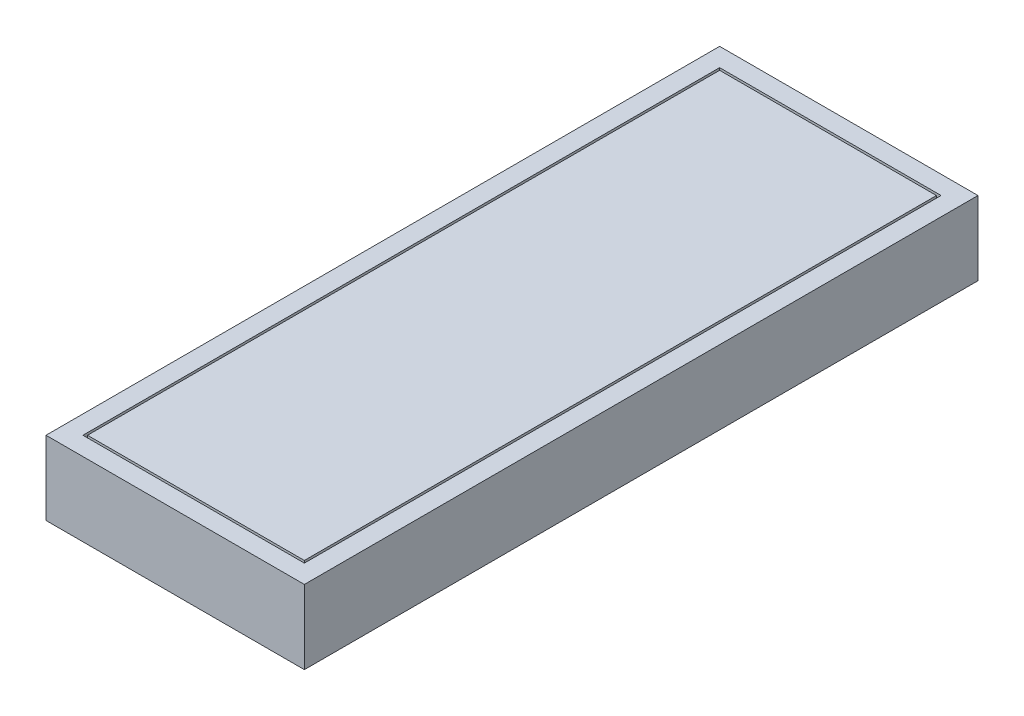
ISO-10303-21;
HEADER;
FILE_DESCRIPTION(('STEP AP214'),'2;1');
FILE_NAME('part.step','',(''),(''),'','','');
FILE_SCHEMA(('AUTOMOTIVE_DESIGN { 1 0 10303 214 1 1 1 1 }'));
ENDSEC;
DATA;
#1=APPLICATION_CONTEXT('core data for automotive mechanical design processes');
#2=APPLICATION_PROTOCOL_DEFINITION('international standard','automotive_design',2000,#1);
#3=PRODUCT_CONTEXT('',#1,'mechanical');
#4=PRODUCT('Part','Part','',(#3));
#5=PRODUCT_RELATED_PRODUCT_CATEGORY('part','',(#4));
#6=PRODUCT_DEFINITION_FORMATION('','',#4);
#7=PRODUCT_DEFINITION_CONTEXT('part definition',#1,'design');
#8=PRODUCT_DEFINITION('design','',#6,#7);
#9=PRODUCT_DEFINITION_SHAPE('','',#8);
#10=(LENGTH_UNIT() NAMED_UNIT(*) SI_UNIT(.MILLI.,.METRE.));
#11=(NAMED_UNIT(*) PLANE_ANGLE_UNIT() SI_UNIT($,.RADIAN.));
#12=(NAMED_UNIT(*) SI_UNIT($,.STERADIAN.) SOLID_ANGLE_UNIT());
#13=UNCERTAINTY_MEASURE_WITH_UNIT(LENGTH_MEASURE(1.E-05),#10,'distance_accuracy_value','');
#14=(GEOMETRIC_REPRESENTATION_CONTEXT(3) GLOBAL_UNCERTAINTY_ASSIGNED_CONTEXT((#13)) GLOBAL_UNIT_ASSIGNED_CONTEXT((#10,
#11,#12)) REPRESENTATION_CONTEXT('',''));
#15=CARTESIAN_POINT('',(0.,0.,0.));
#16=DIRECTION('',(0.,0.,1.));
#17=DIRECTION('',(1.,0.,0.));
#18=AXIS2_PLACEMENT_3D('',#15,#16,#17);
#19=CARTESIAN_POINT('',(0.,8.99999999999999,0.));
#20=DIRECTION('',(0.,1.,0.));
#21=DIRECTION('',(0.,0.,1.));
#22=AXIS2_PLACEMENT_3D('',#19,#20,#21);
#23=PLANE('',#22);
#24=DIRECTION('',(0.,0.,1.));
#25=VECTOR('',#24,1.);
#26=CARTESIAN_POINT('',(-120.,8.99999999999999,20.));
#27=LINE('',#26,#25);
#28=CARTESIAN_POINT('',(-120.,8.99999999999999,20.));
#29=VERTEX_POINT('',#28);
#30=CARTESIAN_POINT('',(-120.,8.99999999999999,710.));
#31=VERTEX_POINT('',#30);
#32=EDGE_CURVE('E153',#29,#31,#27,.T.);
#33=ORIENTED_EDGE('',*,*,#32,.T.);
#34=DIRECTION('',(1.,0.,0.));
#35=VECTOR('',#34,1.);
#36=CARTESIAN_POINT('',(-120.,8.99999999999999,710.));
#37=LINE('',#36,#35);
#38=CARTESIAN_POINT('',(120.,8.99999999999999,710.));
#39=VERTEX_POINT('',#38);
#40=EDGE_CURVE('E156',#31,#39,#37,.T.);
#41=ORIENTED_EDGE('',*,*,#40,.T.);
#42=DIRECTION('',(0.,0.,-1.));
#43=VECTOR('',#42,1.);
#44=CARTESIAN_POINT('',(120.,8.99999999999999,710.));
#45=LINE('',#44,#43);
#46=CARTESIAN_POINT('',(120.,8.99999999999999,20.));
#47=VERTEX_POINT('',#46);
#48=EDGE_CURVE('E160',#39,#47,#45,.T.);
#49=ORIENTED_EDGE('',*,*,#48,.T.);
#50=DIRECTION('',(-1.,0.,0.));
#51=VECTOR('',#50,1.);
#52=CARTESIAN_POINT('',(120.,8.99999999999999,20.));
#53=LINE('',#52,#51);
#54=EDGE_CURVE('E163',#47,#29,#53,.T.);
#55=ORIENTED_EDGE('',*,*,#54,.T.);
#56=EDGE_LOOP('',(#33,#41,#49,#55));
#57=FACE_BOUND('',#56,.T.);
#58=DIRECTION('',(0.,0.,-1.));
#59=VECTOR('',#58,1.);
#60=CARTESIAN_POINT('',(117.5,8.99999999999999,22.5));
#61=LINE('',#60,#59);
#62=CARTESIAN_POINT('',(117.5,8.99999999999999,707.5));
#63=VERTEX_POINT('',#62);
#64=CARTESIAN_POINT('',(117.5,8.99999999999999,22.5));
#65=VERTEX_POINT('',#64);
#66=EDGE_CURVE('E370',#63,#65,#61,.T.);
#67=ORIENTED_EDGE('',*,*,#66,.F.);
#68=DIRECTION('',(1.,0.,0.));
#69=VECTOR('',#68,1.);
#70=CARTESIAN_POINT('',(117.5,8.99999999999999,707.5));
#71=LINE('',#70,#69);
#72=CARTESIAN_POINT('',(-117.5,8.99999999999999,707.5));
#73=VERTEX_POINT('',#72);
#74=EDGE_CURVE('E145',#73,#63,#71,.T.);
#75=ORIENTED_EDGE('',*,*,#74,.F.);
#76=DIRECTION('',(0.,0.,1.));
#77=VECTOR('',#76,1.);
#78=CARTESIAN_POINT('',(-117.5,8.99999999999999,707.5));
#79=LINE('',#78,#77);
#80=CARTESIAN_POINT('',(-117.5,8.99999999999999,22.5));
#81=VERTEX_POINT('',#80);
#82=EDGE_CURVE('E141',#81,#73,#79,.T.);
#83=ORIENTED_EDGE('',*,*,#82,.F.);
#84=DIRECTION('',(-1.,0.,0.));
#85=VECTOR('',#84,1.);
#86=CARTESIAN_POINT('',(-117.5,8.99999999999999,22.5));
#87=LINE('',#86,#85);
#88=EDGE_CURVE('E367',#65,#81,#87,.T.);
#89=ORIENTED_EDGE('',*,*,#88,.F.);
#90=EDGE_LOOP('',(#67,#75,#83,#89));
#91=FACE_BOUND('',#90,.T.);
#92=ADVANCED_FACE('F32',(#57,#91),#23,.T.);
#93=CARTESIAN_POINT('',(-140.,20.,730.));
#94=DIRECTION('',(-1.,0.,0.));
#95=DIRECTION('',(0.,0.,1.));
#96=AXIS2_PLACEMENT_3D('',#93,#94,#95);
#97=PLANE('',#96);
#98=DIRECTION('',(0.,0.,-1.));
#99=VECTOR('',#98,1.);
#100=CARTESIAN_POINT('',(-140.,-60.,730.));
#101=LINE('',#100,#99);
#102=CARTESIAN_POINT('',(-140.,-60.,730.));
#103=VERTEX_POINT('',#102);
#104=CARTESIAN_POINT('',(-140.,-60.,0.));
#105=VERTEX_POINT('',#104);
#106=EDGE_CURVE('E176',#103,#105,#101,.T.);
#107=ORIENTED_EDGE('',*,*,#106,.F.);
#108=DIRECTION('',(0.,-1.,0.));
#109=VECTOR('',#108,1.);
#110=CARTESIAN_POINT('',(-140.,20.,730.));
#111=LINE('',#110,#109);
#112=CARTESIAN_POINT('',(-140.,20.,730.));
#113=VERTEX_POINT('',#112);
#114=EDGE_CURVE('E11',#113,#103,#111,.T.);
#115=ORIENTED_EDGE('',*,*,#114,.F.);
#116=DIRECTION('',(0.,0.,-1.));
#117=VECTOR('',#116,1.);
#118=CARTESIAN_POINT('',(-140.,20.,730.));
#119=LINE('',#118,#117);
#120=CARTESIAN_POINT('',(-140.,20.,0.));
#121=VERTEX_POINT('',#120);
#122=EDGE_CURVE('E182',#113,#121,#119,.T.);
#123=ORIENTED_EDGE('',*,*,#122,.T.);
#124=DIRECTION('',(0.,-1.,0.));
#125=VECTOR('',#124,1.);
#126=CARTESIAN_POINT('',(-140.,20.,0.));
#127=LINE('',#126,#125);
#128=EDGE_CURVE('E36',#121,#105,#127,.T.);
#129=ORIENTED_EDGE('',*,*,#128,.T.);
#130=EDGE_LOOP('',(#107,#115,#123,#129));
#131=FACE_BOUND('',#130,.T.);
#132=ADVANCED_FACE('F34',(#131),#97,.T.);
#133=CARTESIAN_POINT('',(140.,20.,730.));
#134=DIRECTION('',(0.,0.,1.));
#135=DIRECTION('',(1.,0.,0.));
#136=AXIS2_PLACEMENT_3D('',#133,#134,#135);
#137=PLANE('',#136);
#138=DIRECTION('',(-1.,0.,0.));
#139=VECTOR('',#138,1.);
#140=CARTESIAN_POINT('',(140.,-60.,730.));
#141=LINE('',#140,#139);
#142=CARTESIAN_POINT('',(140.,-60.,730.));
#143=VERTEX_POINT('',#142);
#144=EDGE_CURVE('E186',#143,#103,#141,.T.);
#145=ORIENTED_EDGE('',*,*,#144,.F.);
#146=DIRECTION('',(0.,-1.,0.));
#147=VECTOR('',#146,1.);
#148=CARTESIAN_POINT('',(140.,20.,730.));
#149=LINE('',#148,#147);
#150=CARTESIAN_POINT('',(140.,20.,730.));
#151=VERTEX_POINT('',#150);
#152=EDGE_CURVE('E41',#151,#143,#149,.T.);
#153=ORIENTED_EDGE('',*,*,#152,.F.);
#154=DIRECTION('',(-1.,0.,0.));
#155=VECTOR('',#154,1.);
#156=CARTESIAN_POINT('',(140.,20.,730.));
#157=LINE('',#156,#155);
#158=EDGE_CURVE('E192',#151,#113,#157,.T.);
#159=ORIENTED_EDGE('',*,*,#158,.T.);
#160=ORIENTED_EDGE('',*,*,#114,.T.);
#161=EDGE_LOOP('',(#145,#153,#159,#160));
#162=FACE_BOUND('',#161,.T.);
#163=ADVANCED_FACE('F218',(#162),#137,.T.);
#164=CARTESIAN_POINT('',(140.,20.,0.));
#165=DIRECTION('',(1.,0.,0.));
#166=DIRECTION('',(0.,0.,-1.));
#167=AXIS2_PLACEMENT_3D('',#164,#165,#166);
#168=PLANE('',#167);
#169=DIRECTION('',(0.,0.,1.));
#170=VECTOR('',#169,1.);
#171=CARTESIAN_POINT('',(140.,-60.,0.));
#172=LINE('',#171,#170);
#173=CARTESIAN_POINT('',(140.,-60.,0.));
#174=VERTEX_POINT('',#173);
#175=EDGE_CURVE('E200',#174,#143,#172,.T.);
#176=ORIENTED_EDGE('',*,*,#175,.F.);
#177=DIRECTION('',(0.,-1.,0.));
#178=VECTOR('',#177,1.);
#179=CARTESIAN_POINT('',(140.,20.,0.));
#180=LINE('',#179,#178);
#181=CARTESIAN_POINT('',(140.,20.,0.));
#182=VERTEX_POINT('',#181);
#183=EDGE_CURVE('E205',#182,#174,#180,.T.);
#184=ORIENTED_EDGE('',*,*,#183,.F.);
#185=DIRECTION('',(0.,0.,1.));
#186=VECTOR('',#185,1.);
#187=CARTESIAN_POINT('',(140.,20.,0.));
#188=LINE('',#187,#186);
#189=EDGE_CURVE('E189',#182,#151,#188,.T.);
#190=ORIENTED_EDGE('',*,*,#189,.T.);
#191=ORIENTED_EDGE('',*,*,#152,.T.);
#192=EDGE_LOOP('',(#176,#184,#190,#191));
#193=FACE_BOUND('',#192,.T.);
#194=ADVANCED_FACE('F224',(#193),#168,.T.);
#195=CARTESIAN_POINT('',(-140.,20.,0.));
#196=DIRECTION('',(0.,0.,-1.));
#197=DIRECTION('',(-1.,0.,0.));
#198=AXIS2_PLACEMENT_3D('',#195,#196,#197);
#199=PLANE('',#198);
#200=DIRECTION('',(1.,0.,0.));
#201=VECTOR('',#200,1.);
#202=CARTESIAN_POINT('',(-140.,-60.,0.));
#203=LINE('',#202,#201);
#204=EDGE_CURVE('E197',#105,#174,#203,.T.);
#205=ORIENTED_EDGE('',*,*,#204,.F.);
#206=ORIENTED_EDGE('',*,*,#128,.F.);
#207=DIRECTION('',(1.,0.,0.));
#208=VECTOR('',#207,1.);
#209=CARTESIAN_POINT('',(-140.,20.,0.));
#210=LINE('',#209,#208);
#211=EDGE_CURVE('E185',#121,#182,#210,.T.);
#212=ORIENTED_EDGE('',*,*,#211,.T.);
#213=ORIENTED_EDGE('',*,*,#183,.T.);
#214=EDGE_LOOP('',(#205,#206,#212,#213));
#215=FACE_BOUND('',#214,.T.);
#216=ADVANCED_FACE('F213',(#215),#199,.T.);
#217=CARTESIAN_POINT('',(0.,20.,0.));
#218=DIRECTION('',(0.,-1.,0.));
#219=DIRECTION('',(0.,0.,-1.));
#220=AXIS2_PLACEMENT_3D('',#217,#218,#219);
#221=PLANE('',#220);
#222=DIRECTION('',(1.,0.,0.));
#223=VECTOR('',#222,1.);
#224=CARTESIAN_POINT('',(-120.,20.,710.));
#225=LINE('',#224,#223);
#226=CARTESIAN_POINT('',(-120.,20.,710.));
#227=VERTEX_POINT('',#226);
#228=CARTESIAN_POINT('',(120.,20.,710.));
#229=VERTEX_POINT('',#228);
#230=EDGE_CURVE('E148',#227,#229,#225,.T.);
#231=ORIENTED_EDGE('',*,*,#230,.F.);
#232=DIRECTION('',(0.,0.,1.));
#233=VECTOR('',#232,1.);
#234=CARTESIAN_POINT('',(-120.,20.,20.));
#235=LINE('',#234,#233);
#236=CARTESIAN_POINT('',(-120.,20.,20.));
#237=VERTEX_POINT('',#236);
#238=EDGE_CURVE('E57',#237,#227,#235,.T.);
#239=ORIENTED_EDGE('',*,*,#238,.F.);
#240=DIRECTION('',(-1.,0.,0.));
#241=VECTOR('',#240,1.);
#242=CARTESIAN_POINT('',(120.,20.,20.));
#243=LINE('',#242,#241);
#244=CARTESIAN_POINT('',(120.,20.,20.));
#245=VERTEX_POINT('',#244);
#246=EDGE_CURVE('E157',#245,#237,#243,.T.);
#247=ORIENTED_EDGE('',*,*,#246,.F.);
#248=DIRECTION('',(0.,0.,-1.));
#249=VECTOR('',#248,1.);
#250=CARTESIAN_POINT('',(120.,20.,710.));
#251=LINE('',#250,#249);
#252=EDGE_CURVE('E169',#229,#245,#251,.T.);
#253=ORIENTED_EDGE('',*,*,#252,.F.);
#254=EDGE_LOOP('',(#231,#239,#247,#253));
#255=FACE_BOUND('',#254,.T.);
#256=ORIENTED_EDGE('',*,*,#122,.F.);
#257=ORIENTED_EDGE('',*,*,#158,.F.);
#258=ORIENTED_EDGE('',*,*,#189,.F.);
#259=ORIENTED_EDGE('',*,*,#211,.F.);
#260=EDGE_LOOP('',(#256,#257,#258,#259));
#261=FACE_BOUND('',#260,.T.);
#262=ADVANCED_FACE('F221',(#255,#261),#221,.F.);
#263=CARTESIAN_POINT('',(0.,-60.,0.));
#264=DIRECTION('',(0.,-1.,0.));
#265=DIRECTION('',(0.,0.,-1.));
#266=AXIS2_PLACEMENT_3D('',#263,#264,#265);
#267=PLANE('',#266);
#268=ORIENTED_EDGE('',*,*,#106,.T.);
#269=ORIENTED_EDGE('',*,*,#204,.T.);
#270=ORIENTED_EDGE('',*,*,#175,.T.);
#271=ORIENTED_EDGE('',*,*,#144,.T.);
#272=EDGE_LOOP('',(#268,#269,#270,#271));
#273=FACE_BOUND('',#272,.T.);
#274=ADVANCED_FACE('F215',(#273),#267,.T.);
#275=CARTESIAN_POINT('',(-120.,8.99999999999999,20.));
#276=DIRECTION('',(-1.,0.,0.));
#277=DIRECTION('',(0.,0.,1.));
#278=AXIS2_PLACEMENT_3D('',#275,#276,#277);
#279=PLANE('',#278);
#280=ORIENTED_EDGE('',*,*,#238,.T.);
#281=DIRECTION('',(0.,1.,0.));
#282=VECTOR('',#281,1.);
#283=CARTESIAN_POINT('',(-120.,8.99999999999999,710.));
#284=LINE('',#283,#282);
#285=EDGE_CURVE('E165',#31,#227,#284,.T.);
#286=ORIENTED_EDGE('',*,*,#285,.F.);
#287=ORIENTED_EDGE('',*,*,#32,.F.);
#288=DIRECTION('',(0.,1.,0.));
#289=VECTOR('',#288,1.);
#290=CARTESIAN_POINT('',(-120.,8.99999999999999,20.));
#291=LINE('',#290,#289);
#292=EDGE_CURVE('E174',#29,#237,#291,.T.);
#293=ORIENTED_EDGE('',*,*,#292,.T.);
#294=EDGE_LOOP('',(#280,#286,#287,#293));
#295=FACE_BOUND('',#294,.T.);
#296=ADVANCED_FACE('F246',(#295),#279,.F.);
#297=CARTESIAN_POINT('',(120.,8.99999999999999,20.));
#298=DIRECTION('',(0.,0.,-1.));
#299=DIRECTION('',(-1.,0.,0.));
#300=AXIS2_PLACEMENT_3D('',#297,#298,#299);
#301=PLANE('',#300);
#302=ORIENTED_EDGE('',*,*,#246,.T.);
#303=ORIENTED_EDGE('',*,*,#292,.F.);
#304=ORIENTED_EDGE('',*,*,#54,.F.);
#305=DIRECTION('',(0.,1.,0.));
#306=VECTOR('',#305,1.);
#307=CARTESIAN_POINT('',(120.,8.99999999999999,20.));
#308=LINE('',#307,#306);
#309=EDGE_CURVE('E177',#47,#245,#308,.T.);
#310=ORIENTED_EDGE('',*,*,#309,.T.);
#311=EDGE_LOOP('',(#302,#303,#304,#310));
#312=FACE_BOUND('',#311,.T.);
#313=ADVANCED_FACE('F242',(#312),#301,.F.);
#314=CARTESIAN_POINT('',(120.,8.99999999999999,710.));
#315=DIRECTION('',(1.,0.,0.));
#316=DIRECTION('',(0.,0.,-1.));
#317=AXIS2_PLACEMENT_3D('',#314,#315,#316);
#318=PLANE('',#317);
#319=ORIENTED_EDGE('',*,*,#252,.T.);
#320=ORIENTED_EDGE('',*,*,#309,.F.);
#321=ORIENTED_EDGE('',*,*,#48,.F.);
#322=DIRECTION('',(0.,1.,0.));
#323=VECTOR('',#322,1.);
#324=CARTESIAN_POINT('',(120.,8.99999999999999,710.));
#325=LINE('',#324,#323);
#326=EDGE_CURVE('E179',#39,#229,#325,.T.);
#327=ORIENTED_EDGE('',*,*,#326,.T.);
#328=EDGE_LOOP('',(#319,#320,#321,#327));
#329=FACE_BOUND('',#328,.T.);
#330=ADVANCED_FACE('F245',(#329),#318,.F.);
#331=CARTESIAN_POINT('',(-120.,8.99999999999999,710.));
#332=DIRECTION('',(0.,0.,1.));
#333=DIRECTION('',(1.,0.,0.));
#334=AXIS2_PLACEMENT_3D('',#331,#332,#333);
#335=PLANE('',#334);
#336=ORIENTED_EDGE('',*,*,#230,.T.);
#337=ORIENTED_EDGE('',*,*,#326,.F.);
#338=ORIENTED_EDGE('',*,*,#40,.F.);
#339=ORIENTED_EDGE('',*,*,#285,.T.);
#340=EDGE_LOOP('',(#336,#337,#338,#339));
#341=FACE_BOUND('',#340,.T.);
#342=ADVANCED_FACE('F250',(#341),#335,.F.);
#343=CARTESIAN_POINT('',(117.5,20.,707.5));
#344=DIRECTION('',(0.,0.,-1.));
#345=DIRECTION('',(-1.,0.,0.));
#346=AXIS2_PLACEMENT_3D('',#343,#344,#345);
#347=PLANE('',#346);
#348=ORIENTED_EDGE('',*,*,#74,.T.);
#349=DIRECTION('',(0.,-1.,0.));
#350=VECTOR('',#349,1.);
#351=CARTESIAN_POINT('',(117.5,20.,707.5));
#352=LINE('',#351,#350);
#353=CARTESIAN_POINT('',(117.5,20.,707.5));
#354=VERTEX_POINT('',#353);
#355=EDGE_CURVE('E126',#354,#63,#352,.T.);
#356=ORIENTED_EDGE('',*,*,#355,.F.);
#357=DIRECTION('',(1.,0.,0.));
#358=VECTOR('',#357,1.);
#359=CARTESIAN_POINT('',(117.5,20.,707.5));
#360=LINE('',#359,#358);
#361=CARTESIAN_POINT('',(-117.5,20.,707.5));
#362=VERTEX_POINT('',#361);
#363=EDGE_CURVE('E133',#362,#354,#360,.T.);
#364=ORIENTED_EDGE('',*,*,#363,.F.);
#365=DIRECTION('',(0.,-1.,0.));
#366=VECTOR('',#365,1.);
#367=CARTESIAN_POINT('',(-117.5,20.,707.5));
#368=LINE('',#367,#366);
#369=EDGE_CURVE('E365',#362,#73,#368,.T.);
#370=ORIENTED_EDGE('',*,*,#369,.T.);
#371=EDGE_LOOP('',(#348,#356,#364,#370));
#372=FACE_BOUND('',#371,.T.);
#373=ADVANCED_FACE('F143',(#372),#347,.F.);
#374=CARTESIAN_POINT('',(117.5,20.,22.5));
#375=DIRECTION('',(-1.,0.,0.));
#376=DIRECTION('',(0.,0.,1.));
#377=AXIS2_PLACEMENT_3D('',#374,#375,#376);
#378=PLANE('',#377);
#379=ORIENTED_EDGE('',*,*,#66,.T.);
#380=DIRECTION('',(0.,-1.,0.));
#381=VECTOR('',#380,1.);
#382=CARTESIAN_POINT('',(117.5,20.,22.5));
#383=LINE('',#382,#381);
#384=CARTESIAN_POINT('',(117.5,20.,22.5));
#385=VERTEX_POINT('',#384);
#386=EDGE_CURVE('E129',#385,#65,#383,.T.);
#387=ORIENTED_EDGE('',*,*,#386,.F.);
#388=DIRECTION('',(0.,0.,-1.));
#389=VECTOR('',#388,1.);
#390=CARTESIAN_POINT('',(117.5,20.,22.5));
#391=LINE('',#390,#389);
#392=EDGE_CURVE('E122',#354,#385,#391,.T.);
#393=ORIENTED_EDGE('',*,*,#392,.F.);
#394=ORIENTED_EDGE('',*,*,#355,.T.);
#395=EDGE_LOOP('',(#379,#387,#393,#394));
#396=FACE_BOUND('',#395,.T.);
#397=ADVANCED_FACE('F124',(#396),#378,.F.);
#398=CARTESIAN_POINT('',(-117.5,20.,22.5));
#399=DIRECTION('',(0.,0.,1.));
#400=DIRECTION('',(1.,0.,0.));
#401=AXIS2_PLACEMENT_3D('',#398,#399,#400);
#402=PLANE('',#401);
#403=ORIENTED_EDGE('',*,*,#88,.T.);
#404=DIRECTION('',(0.,-1.,0.));
#405=VECTOR('',#404,1.);
#406=CARTESIAN_POINT('',(-117.5,20.,22.5));
#407=LINE('',#406,#405);
#408=CARTESIAN_POINT('',(-117.5,20.,22.5));
#409=VERTEX_POINT('',#408);
#410=EDGE_CURVE('E49',#409,#81,#407,.T.);
#411=ORIENTED_EDGE('',*,*,#410,.F.);
#412=DIRECTION('',(-1.,0.,0.));
#413=VECTOR('',#412,1.);
#414=CARTESIAN_POINT('',(-117.5,20.,22.5));
#415=LINE('',#414,#413);
#416=EDGE_CURVE('E132',#385,#409,#415,.T.);
#417=ORIENTED_EDGE('',*,*,#416,.F.);
#418=ORIENTED_EDGE('',*,*,#386,.T.);
#419=EDGE_LOOP('',(#403,#411,#417,#418));
#420=FACE_BOUND('',#419,.T.);
#421=ADVANCED_FACE('F293',(#420),#402,.F.);
#422=CARTESIAN_POINT('',(-117.5,20.,707.5));
#423=DIRECTION('',(1.,0.,0.));
#424=DIRECTION('',(0.,0.,-1.));
#425=AXIS2_PLACEMENT_3D('',#422,#423,#424);
#426=PLANE('',#425);
#427=ORIENTED_EDGE('',*,*,#82,.T.);
#428=ORIENTED_EDGE('',*,*,#369,.F.);
#429=DIRECTION('',(0.,0.,1.));
#430=VECTOR('',#429,1.);
#431=CARTESIAN_POINT('',(-117.5,20.,707.5));
#432=LINE('',#431,#430);
#433=EDGE_CURVE('E137',#409,#362,#432,.T.);
#434=ORIENTED_EDGE('',*,*,#433,.F.);
#435=ORIENTED_EDGE('',*,*,#410,.T.);
#436=EDGE_LOOP('',(#427,#428,#434,#435));
#437=FACE_BOUND('',#436,.T.);
#438=ADVANCED_FACE('F299',(#437),#426,.F.);
#439=CARTESIAN_POINT('',(0.,20.,0.));
#440=DIRECTION('',(0.,-1.,0.));
#441=DIRECTION('',(0.,0.,-1.));
#442=AXIS2_PLACEMENT_3D('',#439,#440,#441);
#443=PLANE('',#442);
#444=ORIENTED_EDGE('',*,*,#363,.T.);
#445=ORIENTED_EDGE('',*,*,#392,.T.);
#446=ORIENTED_EDGE('',*,*,#416,.T.);
#447=ORIENTED_EDGE('',*,*,#433,.T.);
#448=EDGE_LOOP('',(#444,#445,#446,#447));
#449=FACE_BOUND('',#448,.T.);
#450=ADVANCED_FACE('F136',(#449),#443,.F.);
#451=CLOSED_SHELL('',(#92,#132,#163,#194,#216,#262,#274,#296,#313,#330,#342,#373,#397,#421,#438,#450));
#452=MANIFOLD_SOLID_BREP('B2',#451);
#453=ADVANCED_BREP_SHAPE_REPRESENTATION('',(#18,#452),#14);
#454=SHAPE_DEFINITION_REPRESENTATION(#9,#453);
ENDSEC;
END-ISO-10303-21;
